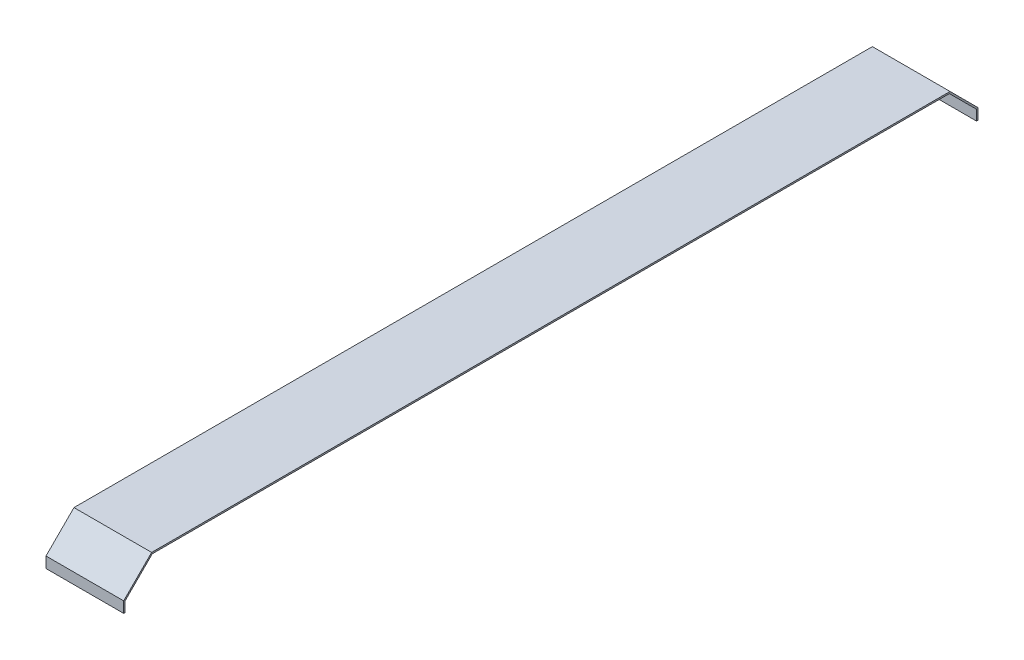
ISO-10303-21;
HEADER;
FILE_DESCRIPTION(('STEP AP214'),'2;1');
FILE_NAME('part.step','',(''),(''),'','','');
FILE_SCHEMA(('AUTOMOTIVE_DESIGN { 1 0 10303 214 1 1 1 1 }'));
ENDSEC;
DATA;
#1=APPLICATION_CONTEXT('core data for automotive mechanical design processes');
#2=APPLICATION_PROTOCOL_DEFINITION('international standard','automotive_design',2000,#1);
#3=PRODUCT_CONTEXT('',#1,'mechanical');
#4=PRODUCT('Part','Part','',(#3));
#5=PRODUCT_RELATED_PRODUCT_CATEGORY('part','',(#4));
#6=PRODUCT_DEFINITION_FORMATION('','',#4);
#7=PRODUCT_DEFINITION_CONTEXT('part definition',#1,'design');
#8=PRODUCT_DEFINITION('design','',#6,#7);
#9=PRODUCT_DEFINITION_SHAPE('','',#8);
#10=(LENGTH_UNIT() NAMED_UNIT(*) SI_UNIT(.MILLI.,.METRE.));
#11=(NAMED_UNIT(*) PLANE_ANGLE_UNIT() SI_UNIT($,.RADIAN.));
#12=(NAMED_UNIT(*) SI_UNIT($,.STERADIAN.) SOLID_ANGLE_UNIT());
#13=UNCERTAINTY_MEASURE_WITH_UNIT(LENGTH_MEASURE(1.E-05),#10,'distance_accuracy_value','');
#14=(GEOMETRIC_REPRESENTATION_CONTEXT(3) GLOBAL_UNCERTAINTY_ASSIGNED_CONTEXT((#13)) GLOBAL_UNIT_ASSIGNED_CONTEXT((#10,
#11,#12)) REPRESENTATION_CONTEXT('',''));
#15=CARTESIAN_POINT('',(0.,0.,0.));
#16=DIRECTION('',(0.,0.,1.));
#17=DIRECTION('',(1.,0.,0.));
#18=AXIS2_PLACEMENT_3D('',#15,#16,#17);
#19=CARTESIAN_POINT('',(50.,0.,-257.));
#20=DIRECTION('',(0.,-0.707106781186548,0.707106781186547));
#21=DIRECTION('',(0.,-0.707106781186547,-0.707106781186548));
#22=AXIS2_PLACEMENT_3D('',#19,#20,#21);
#23=PLANE('',#22);
#24=DIRECTION('',(0.,0.707106781186547,0.707106781186548));
#25=VECTOR('',#24,1.);
#26=CARTESIAN_POINT('',(0.,0.,-257.));
#27=LINE('',#26,#25);
#28=CARTESIAN_POINT('',(0.,-18.,-275.));
#29=VERTEX_POINT('',#28);
#30=CARTESIAN_POINT('',(0.,0.,-257.));
#31=VERTEX_POINT('',#30);
#32=EDGE_CURVE('E155',#29,#31,#27,.T.);
#33=ORIENTED_EDGE('',*,*,#32,.T.);
#34=DIRECTION('',(-1.,0.,0.));
#35=VECTOR('',#34,1.);
#36=CARTESIAN_POINT('',(50.,0.,-257.));
#37=LINE('',#36,#35);
#38=CARTESIAN_POINT('',(50.,0.,-257.));
#39=VERTEX_POINT('',#38);
#40=EDGE_CURVE('E11',#39,#31,#37,.T.);
#41=ORIENTED_EDGE('',*,*,#40,.F.);
#42=DIRECTION('',(0.,0.707106781186547,0.707106781186548));
#43=VECTOR('',#42,1.);
#44=CARTESIAN_POINT('',(50.,0.,-257.));
#45=LINE('',#44,#43);
#46=CARTESIAN_POINT('',(50.,-18.,-275.));
#47=VERTEX_POINT('',#46);
#48=EDGE_CURVE('E177',#47,#39,#45,.T.);
#49=ORIENTED_EDGE('',*,*,#48,.F.);
#50=DIRECTION('',(-1.,0.,0.));
#51=VECTOR('',#50,1.);
#52=CARTESIAN_POINT('',(50.,-18.,-275.));
#53=LINE('',#52,#51);
#54=EDGE_CURVE('E151',#47,#29,#53,.T.);
#55=ORIENTED_EDGE('',*,*,#54,.T.);
#56=EDGE_LOOP('',(#33,#41,#49,#55));
#57=FACE_BOUND('',#56,.T.);
#58=ADVANCED_FACE('F35',(#57),#23,.F.);
#59=CARTESIAN_POINT('',(50.,0.,257.));
#60=DIRECTION('',(0.,-1.,0.));
#61=DIRECTION('',(0.,0.,-1.));
#62=AXIS2_PLACEMENT_3D('',#59,#60,#61);
#63=PLANE('',#62);
#64=DIRECTION('',(0.,0.,1.));
#65=VECTOR('',#64,1.);
#66=CARTESIAN_POINT('',(0.,0.,257.));
#67=LINE('',#66,#65);
#68=CARTESIAN_POINT('',(0.,0.,257.));
#69=VERTEX_POINT('',#68);
#70=EDGE_CURVE('E158',#31,#69,#67,.T.);
#71=ORIENTED_EDGE('',*,*,#70,.T.);
#72=DIRECTION('',(-1.,0.,0.));
#73=VECTOR('',#72,1.);
#74=CARTESIAN_POINT('',(50.,0.,257.));
#75=LINE('',#74,#73);
#76=CARTESIAN_POINT('',(50.,0.,257.));
#77=VERTEX_POINT('',#76);
#78=EDGE_CURVE('E43',#77,#69,#75,.T.);
#79=ORIENTED_EDGE('',*,*,#78,.F.);
#80=DIRECTION('',(0.,0.,1.));
#81=VECTOR('',#80,1.);
#82=CARTESIAN_POINT('',(50.,0.,257.));
#83=LINE('',#82,#81);
#84=EDGE_CURVE('E106',#39,#77,#83,.T.);
#85=ORIENTED_EDGE('',*,*,#84,.F.);
#86=ORIENTED_EDGE('',*,*,#40,.T.);
#87=EDGE_LOOP('',(#71,#79,#85,#86));
#88=FACE_BOUND('',#87,.T.);
#89=ADVANCED_FACE('F255',(#88),#63,.F.);
#90=CARTESIAN_POINT('',(50.,-18.,275.));
#91=DIRECTION('',(0.,-0.707106781186548,-0.707106781186547));
#92=DIRECTION('',(0.,0.707106781186547,-0.707106781186548));
#93=AXIS2_PLACEMENT_3D('',#90,#91,#92);
#94=PLANE('',#93);
#95=DIRECTION('',(0.,-0.707106781186547,0.707106781186548));
#96=VECTOR('',#95,1.);
#97=CARTESIAN_POINT('',(0.,-18.,275.));
#98=LINE('',#97,#96);
#99=CARTESIAN_POINT('',(0.,-18.,275.));
#100=VERTEX_POINT('',#99);
#101=EDGE_CURVE('E160',#69,#100,#98,.T.);
#102=ORIENTED_EDGE('',*,*,#101,.T.);
#103=DIRECTION('',(-1.,0.,0.));
#104=VECTOR('',#103,1.);
#105=CARTESIAN_POINT('',(50.,-18.,275.));
#106=LINE('',#105,#104);
#107=CARTESIAN_POINT('',(50.,-18.,275.));
#108=VERTEX_POINT('',#107);
#109=EDGE_CURVE('E196',#108,#100,#106,.T.);
#110=ORIENTED_EDGE('',*,*,#109,.F.);
#111=DIRECTION('',(0.,-0.707106781186547,0.707106781186548));
#112=VECTOR('',#111,1.);
#113=CARTESIAN_POINT('',(50.,-18.,275.));
#114=LINE('',#113,#112);
#115=EDGE_CURVE('E204',#77,#108,#114,.T.);
#116=ORIENTED_EDGE('',*,*,#115,.F.);
#117=ORIENTED_EDGE('',*,*,#78,.T.);
#118=EDGE_LOOP('',(#102,#110,#116,#117));
#119=FACE_BOUND('',#118,.T.);
#120=ADVANCED_FACE('F202',(#119),#94,.F.);
#121=CARTESIAN_POINT('',(50.,-18.,275.));
#122=DIRECTION('',(0.,0.,-1.));
#123=DIRECTION('',(-1.,0.,0.));
#124=AXIS2_PLACEMENT_3D('',#121,#122,#123);
#125=PLANE('',#124);
#126=DIRECTION('',(0.,-1.,0.));
#127=VECTOR('',#126,1.);
#128=CARTESIAN_POINT('',(0.,-18.,275.));
#129=LINE('',#128,#127);
#130=CARTESIAN_POINT('',(0.,-25.,275.));
#131=VERTEX_POINT('',#130);
#132=EDGE_CURVE('E162',#100,#131,#129,.T.);
#133=ORIENTED_EDGE('',*,*,#132,.T.);
#134=DIRECTION('',(-1.,0.,0.));
#135=VECTOR('',#134,1.);
#136=CARTESIAN_POINT('',(50.,-25.,275.));
#137=LINE('',#136,#135);
#138=CARTESIAN_POINT('',(50.,-25.,275.));
#139=VERTEX_POINT('',#138);
#140=EDGE_CURVE('E193',#139,#131,#137,.T.);
#141=ORIENTED_EDGE('',*,*,#140,.F.);
#142=DIRECTION('',(0.,-1.,0.));
#143=VECTOR('',#142,1.);
#144=CARTESIAN_POINT('',(50.,-18.,275.));
#145=LINE('',#144,#143);
#146=EDGE_CURVE('E222',#108,#139,#145,.T.);
#147=ORIENTED_EDGE('',*,*,#146,.F.);
#148=ORIENTED_EDGE('',*,*,#109,.T.);
#149=EDGE_LOOP('',(#133,#141,#147,#148));
#150=FACE_BOUND('',#149,.T.);
#151=ADVANCED_FACE('F213',(#150),#125,.F.);
#152=CARTESIAN_POINT('',(50.,-25.,275.));
#153=DIRECTION('',(0.,1.,0.));
#154=DIRECTION('',(0.,0.,1.));
#155=AXIS2_PLACEMENT_3D('',#152,#153,#154);
#156=PLANE('',#155);
#157=DIRECTION('',(0.,0.,-1.));
#158=VECTOR('',#157,1.);
#159=CARTESIAN_POINT('',(0.,-25.,275.));
#160=LINE('',#159,#158);
#161=CARTESIAN_POINT('',(0.,-25.,274.));
#162=VERTEX_POINT('',#161);
#163=EDGE_CURVE('E164',#131,#162,#160,.T.);
#164=ORIENTED_EDGE('',*,*,#163,.T.);
#165=DIRECTION('',(-1.,0.,0.));
#166=VECTOR('',#165,1.);
#167=CARTESIAN_POINT('',(50.,-25.,274.));
#168=LINE('',#167,#166);
#169=CARTESIAN_POINT('',(50.,-25.,274.));
#170=VERTEX_POINT('',#169);
#171=EDGE_CURVE('E190',#170,#162,#168,.T.);
#172=ORIENTED_EDGE('',*,*,#171,.F.);
#173=DIRECTION('',(0.,0.,-1.));
#174=VECTOR('',#173,1.);
#175=CARTESIAN_POINT('',(50.,-25.,275.));
#176=LINE('',#175,#174);
#177=EDGE_CURVE('E219',#139,#170,#176,.T.);
#178=ORIENTED_EDGE('',*,*,#177,.F.);
#179=ORIENTED_EDGE('',*,*,#140,.T.);
#180=EDGE_LOOP('',(#164,#172,#178,#179));
#181=FACE_BOUND('',#180,.T.);
#182=ADVANCED_FACE('F217',(#181),#156,.F.);
#183=CARTESIAN_POINT('',(50.,-18.4142135623731,274.));
#184=DIRECTION('',(0.,0.,1.));
#185=DIRECTION('',(1.,0.,0.));
#186=AXIS2_PLACEMENT_3D('',#183,#184,#185);
#187=PLANE('',#186);
#188=DIRECTION('',(0.,1.,0.));
#189=VECTOR('',#188,1.);
#190=CARTESIAN_POINT('',(0.,-18.4142135623731,274.));
#191=LINE('',#190,#189);
#192=CARTESIAN_POINT('',(0.,-18.4142135623731,274.));
#193=VERTEX_POINT('',#192);
#194=EDGE_CURVE('E166',#162,#193,#191,.T.);
#195=ORIENTED_EDGE('',*,*,#194,.T.);
#196=DIRECTION('',(-1.,0.,0.));
#197=VECTOR('',#196,1.);
#198=CARTESIAN_POINT('',(50.,-18.4142135623731,274.));
#199=LINE('',#198,#197);
#200=CARTESIAN_POINT('',(50.,-18.4142135623731,274.));
#201=VERTEX_POINT('',#200);
#202=EDGE_CURVE('E187',#201,#193,#199,.T.);
#203=ORIENTED_EDGE('',*,*,#202,.F.);
#204=DIRECTION('',(0.,1.,0.));
#205=VECTOR('',#204,1.);
#206=CARTESIAN_POINT('',(50.,-18.4142135623731,274.));
#207=LINE('',#206,#205);
#208=EDGE_CURVE('E221',#170,#201,#207,.T.);
#209=ORIENTED_EDGE('',*,*,#208,.F.);
#210=ORIENTED_EDGE('',*,*,#171,.T.);
#211=EDGE_LOOP('',(#195,#203,#209,#210));
#212=FACE_BOUND('',#211,.T.);
#213=ADVANCED_FACE('F268',(#212),#187,.F.);
#214=CARTESIAN_POINT('',(50.,-18.4142135623731,274.));
#215=DIRECTION('',(0.,0.707106781186548,0.707106781186547));
#216=DIRECTION('',(0.,-0.707106781186547,0.707106781186548));
#217=AXIS2_PLACEMENT_3D('',#214,#215,#216);
#218=PLANE('',#217);
#219=DIRECTION('',(0.,0.707106781186547,-0.707106781186548));
#220=VECTOR('',#219,1.);
#221=CARTESIAN_POINT('',(0.,-18.4142135623731,274.));
#222=LINE('',#221,#220);
#223=CARTESIAN_POINT('',(0.,-1.,256.585786437627));
#224=VERTEX_POINT('',#223);
#225=EDGE_CURVE('E168',#193,#224,#222,.T.);
#226=ORIENTED_EDGE('',*,*,#225,.T.);
#227=DIRECTION('',(-1.,0.,0.));
#228=VECTOR('',#227,1.);
#229=CARTESIAN_POINT('',(50.,-1.,256.585786437627));
#230=LINE('',#229,#228);
#231=CARTESIAN_POINT('',(50.,-1.,256.585786437627));
#232=VERTEX_POINT('',#231);
#233=EDGE_CURVE('E184',#232,#224,#230,.T.);
#234=ORIENTED_EDGE('',*,*,#233,.F.);
#235=DIRECTION('',(0.,0.707106781186547,-0.707106781186548));
#236=VECTOR('',#235,1.);
#237=CARTESIAN_POINT('',(50.,-18.4142135623731,274.));
#238=LINE('',#237,#236);
#239=EDGE_CURVE('E224',#201,#232,#238,.T.);
#240=ORIENTED_EDGE('',*,*,#239,.F.);
#241=ORIENTED_EDGE('',*,*,#202,.T.);
#242=EDGE_LOOP('',(#226,#234,#240,#241));
#243=FACE_BOUND('',#242,.T.);
#244=ADVANCED_FACE('F271',(#243),#218,.F.);
#245=CARTESIAN_POINT('',(50.,-1.,256.585786437627));
#246=DIRECTION('',(0.,1.,0.));
#247=DIRECTION('',(0.,0.,1.));
#248=AXIS2_PLACEMENT_3D('',#245,#246,#247);
#249=PLANE('',#248);
#250=DIRECTION('',(0.,0.,-1.));
#251=VECTOR('',#250,1.);
#252=CARTESIAN_POINT('',(0.,-1.,256.585786437627));
#253=LINE('',#252,#251);
#254=CARTESIAN_POINT('',(0.,-1.,-256.585786437627));
#255=VERTEX_POINT('',#254);
#256=EDGE_CURVE('E170',#224,#255,#253,.T.);
#257=ORIENTED_EDGE('',*,*,#256,.T.);
#258=DIRECTION('',(-1.,0.,0.));
#259=VECTOR('',#258,1.);
#260=CARTESIAN_POINT('',(50.,-1.,-256.585786437627));
#261=LINE('',#260,#259);
#262=CARTESIAN_POINT('',(50.,-1.,-256.585786437627));
#263=VERTEX_POINT('',#262);
#264=EDGE_CURVE('E181',#263,#255,#261,.T.);
#265=ORIENTED_EDGE('',*,*,#264,.F.);
#266=DIRECTION('',(0.,0.,-1.));
#267=VECTOR('',#266,1.);
#268=CARTESIAN_POINT('',(50.,-1.,256.585786437627));
#269=LINE('',#268,#267);
#270=EDGE_CURVE('E230',#232,#263,#269,.T.);
#271=ORIENTED_EDGE('',*,*,#270,.F.);
#272=ORIENTED_EDGE('',*,*,#233,.T.);
#273=EDGE_LOOP('',(#257,#265,#271,#272));
#274=FACE_BOUND('',#273,.T.);
#275=ADVANCED_FACE('F236',(#274),#249,.F.);
#276=CARTESIAN_POINT('',(50.,-1.,-256.585786437627));
#277=DIRECTION('',(0.,0.707106781186548,-0.707106781186547));
#278=DIRECTION('',(0.,0.707106781186547,0.707106781186548));
#279=AXIS2_PLACEMENT_3D('',#276,#277,#278);
#280=PLANE('',#279);
#281=DIRECTION('',(0.,-0.707106781186547,-0.707106781186548));
#282=VECTOR('',#281,1.);
#283=CARTESIAN_POINT('',(0.,-1.,-256.585786437627));
#284=LINE('',#283,#282);
#285=CARTESIAN_POINT('',(0.,-18.4142135623731,-274.));
#286=VERTEX_POINT('',#285);
#287=EDGE_CURVE('E172',#255,#286,#284,.T.);
#288=ORIENTED_EDGE('',*,*,#287,.T.);
#289=DIRECTION('',(-1.,0.,0.));
#290=VECTOR('',#289,1.);
#291=CARTESIAN_POINT('',(50.,-18.4142135623731,-274.));
#292=LINE('',#291,#290);
#293=CARTESIAN_POINT('',(50.,-18.4142135623731,-274.));
#294=VERTEX_POINT('',#293);
#295=EDGE_CURVE('E146',#294,#286,#292,.T.);
#296=ORIENTED_EDGE('',*,*,#295,.F.);
#297=DIRECTION('',(0.,-0.707106781186547,-0.707106781186548));
#298=VECTOR('',#297,1.);
#299=CARTESIAN_POINT('',(50.,-1.,-256.585786437627));
#300=LINE('',#299,#298);
#301=EDGE_CURVE('E137',#263,#294,#300,.T.);
#302=ORIENTED_EDGE('',*,*,#301,.F.);
#303=ORIENTED_EDGE('',*,*,#264,.T.);
#304=EDGE_LOOP('',(#288,#296,#302,#303));
#305=FACE_BOUND('',#304,.T.);
#306=ADVANCED_FACE('F240',(#305),#280,.F.);
#307=CARTESIAN_POINT('',(50.,-18.4142135623731,-274.));
#308=DIRECTION('',(0.,0.,-1.));
#309=DIRECTION('',(-1.,0.,0.));
#310=AXIS2_PLACEMENT_3D('',#307,#308,#309);
#311=PLANE('',#310);
#312=DIRECTION('',(0.,-1.,0.));
#313=VECTOR('',#312,1.);
#314=CARTESIAN_POINT('',(0.,-18.4142135623731,-274.));
#315=LINE('',#314,#313);
#316=CARTESIAN_POINT('',(0.,-25.,-274.));
#317=VERTEX_POINT('',#316);
#318=EDGE_CURVE('E145',#286,#317,#315,.T.);
#319=ORIENTED_EDGE('',*,*,#318,.T.);
#320=DIRECTION('',(-1.,0.,0.));
#321=VECTOR('',#320,1.);
#322=CARTESIAN_POINT('',(50.,-25.,-274.));
#323=LINE('',#322,#321);
#324=CARTESIAN_POINT('',(50.,-25.,-274.));
#325=VERTEX_POINT('',#324);
#326=EDGE_CURVE('E142',#325,#317,#323,.T.);
#327=ORIENTED_EDGE('',*,*,#326,.F.);
#328=DIRECTION('',(0.,-1.,0.));
#329=VECTOR('',#328,1.);
#330=CARTESIAN_POINT('',(50.,-18.4142135623731,-274.));
#331=LINE('',#330,#329);
#332=EDGE_CURVE('E131',#294,#325,#331,.T.);
#333=ORIENTED_EDGE('',*,*,#332,.F.);
#334=ORIENTED_EDGE('',*,*,#295,.T.);
#335=EDGE_LOOP('',(#319,#327,#333,#334));
#336=FACE_BOUND('',#335,.T.);
#337=ADVANCED_FACE('F143',(#336),#311,.F.);
#338=CARTESIAN_POINT('',(50.,-25.,-274.));
#339=DIRECTION('',(0.,1.,0.));
#340=DIRECTION('',(0.,0.,1.));
#341=AXIS2_PLACEMENT_3D('',#338,#339,#340);
#342=PLANE('',#341);
#343=DIRECTION('',(0.,0.,-1.));
#344=VECTOR('',#343,1.);
#345=CARTESIAN_POINT('',(0.,-25.,-274.));
#346=LINE('',#345,#344);
#347=CARTESIAN_POINT('',(0.,-25.,-275.));
#348=VERTEX_POINT('',#347);
#349=EDGE_CURVE('E92',#317,#348,#346,.T.);
#350=ORIENTED_EDGE('',*,*,#349,.T.);
#351=DIRECTION('',(-1.,0.,0.));
#352=VECTOR('',#351,1.);
#353=CARTESIAN_POINT('',(50.,-25.,-275.));
#354=LINE('',#353,#352);
#355=CARTESIAN_POINT('',(50.,-25.,-275.));
#356=VERTEX_POINT('',#355);
#357=EDGE_CURVE('E147',#356,#348,#354,.T.);
#358=ORIENTED_EDGE('',*,*,#357,.F.);
#359=DIRECTION('',(0.,0.,-1.));
#360=VECTOR('',#359,1.);
#361=CARTESIAN_POINT('',(50.,-25.,-274.));
#362=LINE('',#361,#360);
#363=EDGE_CURVE('E135',#325,#356,#362,.T.);
#364=ORIENTED_EDGE('',*,*,#363,.F.);
#365=ORIENTED_EDGE('',*,*,#326,.T.);
#366=EDGE_LOOP('',(#350,#358,#364,#365));
#367=FACE_BOUND('',#366,.T.);
#368=ADVANCED_FACE('F149',(#367),#342,.F.);
#369=CARTESIAN_POINT('',(50.,-18.,-275.));
#370=DIRECTION('',(0.,0.,1.));
#371=DIRECTION('',(1.,0.,0.));
#372=AXIS2_PLACEMENT_3D('',#369,#370,#371);
#373=PLANE('',#372);
#374=DIRECTION('',(0.,1.,0.));
#375=VECTOR('',#374,1.);
#376=CARTESIAN_POINT('',(0.,-18.,-275.));
#377=LINE('',#376,#375);
#378=EDGE_CURVE('E98',#348,#29,#377,.T.);
#379=ORIENTED_EDGE('',*,*,#378,.T.);
#380=ORIENTED_EDGE('',*,*,#54,.F.);
#381=DIRECTION('',(0.,1.,0.));
#382=VECTOR('',#381,1.);
#383=CARTESIAN_POINT('',(50.,-18.,-275.));
#384=LINE('',#383,#382);
#385=EDGE_CURVE('E51',#356,#47,#384,.T.);
#386=ORIENTED_EDGE('',*,*,#385,.F.);
#387=ORIENTED_EDGE('',*,*,#357,.T.);
#388=EDGE_LOOP('',(#379,#380,#386,#387));
#389=FACE_BOUND('',#388,.T.);
#390=ADVANCED_FACE('F244',(#389),#373,.F.);
#391=CARTESIAN_POINT('',(50.,0.,0.));
#392=DIRECTION('',(1.,0.,0.));
#393=DIRECTION('',(0.,0.,-1.));
#394=AXIS2_PLACEMENT_3D('',#391,#392,#393);
#395=PLANE('',#394);
#396=ORIENTED_EDGE('',*,*,#48,.T.);
#397=ORIENTED_EDGE('',*,*,#84,.T.);
#398=ORIENTED_EDGE('',*,*,#115,.T.);
#399=ORIENTED_EDGE('',*,*,#146,.T.);
#400=ORIENTED_EDGE('',*,*,#177,.T.);
#401=ORIENTED_EDGE('',*,*,#208,.T.);
#402=ORIENTED_EDGE('',*,*,#239,.T.);
#403=ORIENTED_EDGE('',*,*,#270,.T.);
#404=ORIENTED_EDGE('',*,*,#301,.T.);
#405=ORIENTED_EDGE('',*,*,#332,.T.);
#406=ORIENTED_EDGE('',*,*,#363,.T.);
#407=ORIENTED_EDGE('',*,*,#385,.T.);
#408=EDGE_LOOP('',(#396,#397,#398,#399,#400,#401,#402,#403,#404,#405,#406,#407));
#409=FACE_BOUND('',#408,.T.);
#410=ADVANCED_FACE('F133',(#409),#395,.T.);
#411=CARTESIAN_POINT('',(0.,0.,0.));
#412=DIRECTION('',(1.,0.,0.));
#413=DIRECTION('',(0.,0.,-1.));
#414=AXIS2_PLACEMENT_3D('',#411,#412,#413);
#415=PLANE('',#414);
#416=ORIENTED_EDGE('',*,*,#32,.F.);
#417=ORIENTED_EDGE('',*,*,#378,.F.);
#418=ORIENTED_EDGE('',*,*,#349,.F.);
#419=ORIENTED_EDGE('',*,*,#318,.F.);
#420=ORIENTED_EDGE('',*,*,#287,.F.);
#421=ORIENTED_EDGE('',*,*,#256,.F.);
#422=ORIENTED_EDGE('',*,*,#225,.F.);
#423=ORIENTED_EDGE('',*,*,#194,.F.);
#424=ORIENTED_EDGE('',*,*,#163,.F.);
#425=ORIENTED_EDGE('',*,*,#132,.F.);
#426=ORIENTED_EDGE('',*,*,#101,.F.);
#427=ORIENTED_EDGE('',*,*,#70,.F.);
#428=EDGE_LOOP('',(#416,#417,#418,#419,#420,#421,#422,#423,#424,#425,#426,#427));
#429=FACE_BOUND('',#428,.T.);
#430=ADVANCED_FACE('F208',(#429),#415,.F.);
#431=CLOSED_SHELL('',(#58,#89,#120,#151,#182,#213,#244,#275,#306,#337,#368,#390,#410,#430));
#432=MANIFOLD_SOLID_BREP('B2',#431);
#433=ADVANCED_BREP_SHAPE_REPRESENTATION('',(#18,#432),#14);
#434=SHAPE_DEFINITION_REPRESENTATION(#9,#433);
ENDSEC;
END-ISO-10303-21;
